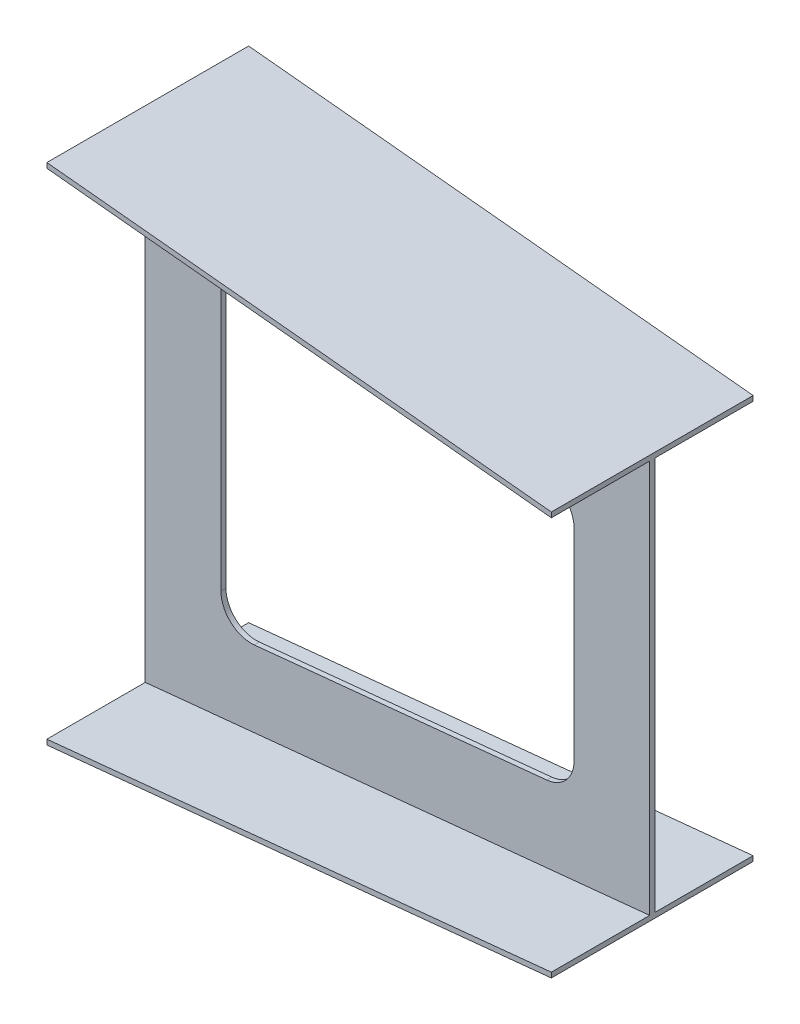
ISO-10303-21;
HEADER;
FILE_DESCRIPTION(('STEP AP214'),'2;1');
FILE_NAME('part.step','',(''),(''),'','','');
FILE_SCHEMA(('AUTOMOTIVE_DESIGN { 1 0 10303 214 1 1 1 1 }'));
ENDSEC;
DATA;
#1=APPLICATION_CONTEXT('core data for automotive mechanical design processes');
#2=APPLICATION_PROTOCOL_DEFINITION('international standard','automotive_design',2000,#1);
#3=PRODUCT_CONTEXT('',#1,'mechanical');
#4=PRODUCT('Part','Part','',(#3));
#5=PRODUCT_RELATED_PRODUCT_CATEGORY('part','',(#4));
#6=PRODUCT_DEFINITION_FORMATION('','',#4);
#7=PRODUCT_DEFINITION_CONTEXT('part definition',#1,'design');
#8=PRODUCT_DEFINITION('design','',#6,#7);
#9=PRODUCT_DEFINITION_SHAPE('','',#8);
#10=(LENGTH_UNIT() NAMED_UNIT(*) SI_UNIT(.MILLI.,.METRE.));
#11=(NAMED_UNIT(*) PLANE_ANGLE_UNIT() SI_UNIT($,.RADIAN.));
#12=(NAMED_UNIT(*) SI_UNIT($,.STERADIAN.) SOLID_ANGLE_UNIT());
#13=UNCERTAINTY_MEASURE_WITH_UNIT(LENGTH_MEASURE(1.E-05),#10,'distance_accuracy_value','');
#14=(GEOMETRIC_REPRESENTATION_CONTEXT(3) GLOBAL_UNCERTAINTY_ASSIGNED_CONTEXT((#13)) GLOBAL_UNIT_ASSIGNED_CONTEXT((#10,
#11,#12)) REPRESENTATION_CONTEXT('',''));
#15=CARTESIAN_POINT('',(0.,0.,0.));
#16=DIRECTION('',(0.,0.,1.));
#17=DIRECTION('',(1.,0.,0.));
#18=AXIS2_PLACEMENT_3D('',#15,#16,#17);
#19=CARTESIAN_POINT('',(1000.,0.,0.));
#20=DIRECTION('',(-1.,0.,0.));
#21=DIRECTION('',(0.,0.,1.));
#22=AXIS2_PLACEMENT_3D('',#19,#20,#21);
#23=PLANE('',#22);
#24=DIRECTION('',(0.,-1.,0.));
#25=VECTOR('',#24,1.);
#26=CARTESIAN_POINT('',(1000.,400.,-195.));
#27=LINE('',#26,#25);
#28=CARTESIAN_POINT('',(1000.,400.,-195.));
#29=VERTEX_POINT('',#28);
#30=CARTESIAN_POINT('',(1000.,390.,-195.));
#31=VERTEX_POINT('',#30);
#32=EDGE_CURVE('E561',#29,#31,#27,.T.);
#33=ORIENTED_EDGE('',*,*,#32,.F.);
#34=DIRECTION('',(0.,0.,-1.));
#35=VECTOR('',#34,1.);
#36=CARTESIAN_POINT('',(1000.,400.,-195.));
#37=LINE('',#36,#35);
#38=CARTESIAN_POINT('',(1000.,400.,205.));
#39=VERTEX_POINT('',#38);
#40=EDGE_CURVE('E12',#39,#29,#37,.T.);
#41=ORIENTED_EDGE('',*,*,#40,.F.);
#42=DIRECTION('',(0.,1.,0.));
#43=VECTOR('',#42,1.);
#44=CARTESIAN_POINT('',(1000.,400.,205.));
#45=LINE('',#44,#43);
#46=CARTESIAN_POINT('',(1000.,390.,205.));
#47=VERTEX_POINT('',#46);
#48=EDGE_CURVE('E71',#47,#39,#45,.T.);
#49=ORIENTED_EDGE('',*,*,#48,.F.);
#50=DIRECTION('',(0.,0.,1.));
#51=VECTOR('',#50,1.);
#52=CARTESIAN_POINT('',(1000.,390.,9.99999999999979));
#53=LINE('',#52,#51);
#54=CARTESIAN_POINT('',(1000.,390.,9.99999999999979));
#55=VERTEX_POINT('',#54);
#56=EDGE_CURVE('E326',#55,#47,#53,.T.);
#57=ORIENTED_EDGE('',*,*,#56,.F.);
#58=DIRECTION('',(0.,1.,0.));
#59=VECTOR('',#58,1.);
#60=CARTESIAN_POINT('',(1000.,390.,9.99999999999979));
#61=LINE('',#60,#59);
#62=CARTESIAN_POINT('',(1000.,-390.,9.99999999999979));
#63=VERTEX_POINT('',#62);
#64=EDGE_CURVE('E766',#63,#55,#61,.T.);
#65=ORIENTED_EDGE('',*,*,#64,.F.);
#66=DIRECTION('',(0.,0.,-1.));
#67=VECTOR('',#66,1.);
#68=CARTESIAN_POINT('',(1000.,-390.,9.99999999999979));
#69=LINE('',#68,#67);
#70=CARTESIAN_POINT('',(1000.,-390.,205.));
#71=VERTEX_POINT('',#70);
#72=EDGE_CURVE('E757',#71,#63,#69,.T.);
#73=ORIENTED_EDGE('',*,*,#72,.F.);
#74=DIRECTION('',(0.,1.,0.));
#75=VECTOR('',#74,1.);
#76=CARTESIAN_POINT('',(1000.,-390.,205.));
#77=LINE('',#76,#75);
#78=CARTESIAN_POINT('',(1000.,-400.,205.));
#79=VERTEX_POINT('',#78);
#80=EDGE_CURVE('E749',#79,#71,#77,.T.);
#81=ORIENTED_EDGE('',*,*,#80,.F.);
#82=DIRECTION('',(0.,0.,1.));
#83=VECTOR('',#82,1.);
#84=CARTESIAN_POINT('',(1000.,-400.,-195.));
#85=LINE('',#84,#83);
#86=CARTESIAN_POINT('',(1000.,-400.,-195.));
#87=VERTEX_POINT('',#86);
#88=EDGE_CURVE('E443',#87,#79,#85,.T.);
#89=ORIENTED_EDGE('',*,*,#88,.F.);
#90=DIRECTION('',(0.,-1.,0.));
#91=VECTOR('',#90,1.);
#92=CARTESIAN_POINT('',(1000.,-390.,-195.));
#93=LINE('',#92,#91);
#94=CARTESIAN_POINT('',(1000.,-390.,-195.));
#95=VERTEX_POINT('',#94);
#96=EDGE_CURVE('E457',#95,#87,#93,.T.);
#97=ORIENTED_EDGE('',*,*,#96,.F.);
#98=DIRECTION('',(0.,0.,-1.));
#99=VECTOR('',#98,1.);
#100=CARTESIAN_POINT('',(1000.,-390.,-195.));
#101=LINE('',#100,#99);
#102=CARTESIAN_POINT('',(1000.,-390.,0.));
#103=VERTEX_POINT('',#102);
#104=EDGE_CURVE('E727',#103,#95,#101,.T.);
#105=ORIENTED_EDGE('',*,*,#104,.F.);
#106=DIRECTION('',(0.,-1.,0.));
#107=VECTOR('',#106,1.);
#108=CARTESIAN_POINT('',(1000.,390.,0.));
#109=LINE('',#108,#107);
#110=CARTESIAN_POINT('',(1000.,390.,0.));
#111=VERTEX_POINT('',#110);
#112=EDGE_CURVE('E703',#111,#103,#109,.T.);
#113=ORIENTED_EDGE('',*,*,#112,.F.);
#114=DIRECTION('',(0.,0.,1.));
#115=VECTOR('',#114,1.);
#116=CARTESIAN_POINT('',(1000.,390.,-195.));
#117=LINE('',#116,#115);
#118=EDGE_CURVE('E547',#31,#111,#117,.T.);
#119=ORIENTED_EDGE('',*,*,#118,.F.);
#120=EDGE_LOOP('',(#33,#41,#49,#57,#65,#73,#81,#89,#97,#105,#113,#119));
#121=FACE_BOUND('',#120,.T.);
#122=ADVANCED_FACE('F61',(#121),#23,.F.);
#123=CARTESIAN_POINT('',(0.,0.,0.));
#124=DIRECTION('',(1.,0.,0.));
#125=DIRECTION('',(0.,0.,-1.));
#126=AXIS2_PLACEMENT_3D('',#123,#124,#125);
#127=PLANE('',#126);
#128=DIRECTION('',(0.,-1.,0.));
#129=VECTOR('',#128,1.);
#130=CARTESIAN_POINT('',(0.,500.,205.));
#131=LINE('',#130,#129);
#132=CARTESIAN_POINT('',(0.,500.,205.));
#133=VERTEX_POINT('',#132);
#134=CARTESIAN_POINT('',(0.,490.,205.));
#135=VERTEX_POINT('',#134);
#136=EDGE_CURVE('E258',#133,#135,#131,.T.);
#137=ORIENTED_EDGE('',*,*,#136,.F.);
#138=DIRECTION('',(0.,0.,1.));
#139=VECTOR('',#138,1.);
#140=CARTESIAN_POINT('',(0.,500.,205.));
#141=LINE('',#140,#139);
#142=CARTESIAN_POINT('',(0.,500.,-195.));
#143=VERTEX_POINT('',#142);
#144=EDGE_CURVE('E275',#143,#133,#141,.T.);
#145=ORIENTED_EDGE('',*,*,#144,.F.);
#146=DIRECTION('',(0.,1.,0.));
#147=VECTOR('',#146,1.);
#148=CARTESIAN_POINT('',(0.,500.,-195.));
#149=LINE('',#148,#147);
#150=CARTESIAN_POINT('',(0.,490.,-195.));
#151=VERTEX_POINT('',#150);
#152=EDGE_CURVE('E576',#151,#143,#149,.T.);
#153=ORIENTED_EDGE('',*,*,#152,.F.);
#154=DIRECTION('',(0.,0.,-1.));
#155=VECTOR('',#154,1.);
#156=CARTESIAN_POINT('',(0.,490.,0.));
#157=LINE('',#156,#155);
#158=CARTESIAN_POINT('',(0.,490.,0.));
#159=VERTEX_POINT('',#158);
#160=EDGE_CURVE('E682',#159,#151,#157,.T.);
#161=ORIENTED_EDGE('',*,*,#160,.F.);
#162=DIRECTION('',(0.,1.,0.));
#163=VECTOR('',#162,1.);
#164=CARTESIAN_POINT('',(0.,490.,0.));
#165=LINE('',#164,#163);
#166=CARTESIAN_POINT('',(0.,-490.,-1.11022302462516E-13));
#167=VERTEX_POINT('',#166);
#168=EDGE_CURVE('E516',#167,#159,#165,.T.);
#169=ORIENTED_EDGE('',*,*,#168,.F.);
#170=DIRECTION('',(0.,0.,1.));
#171=VECTOR('',#170,1.);
#172=CARTESIAN_POINT('',(0.,-490.,-1.11022302462516E-13));
#173=LINE('',#172,#171);
#174=CARTESIAN_POINT('',(0.,-490.,-195.));
#175=VERTEX_POINT('',#174);
#176=EDGE_CURVE('E499',#175,#167,#173,.T.);
#177=ORIENTED_EDGE('',*,*,#176,.F.);
#178=DIRECTION('',(0.,1.,0.));
#179=VECTOR('',#178,1.);
#180=CARTESIAN_POINT('',(0.,-490.,-195.));
#181=LINE('',#180,#179);
#182=CARTESIAN_POINT('',(0.,-500.,-195.));
#183=VERTEX_POINT('',#182);
#184=EDGE_CURVE('E675',#183,#175,#181,.T.);
#185=ORIENTED_EDGE('',*,*,#184,.F.);
#186=DIRECTION('',(0.,0.,-1.));
#187=VECTOR('',#186,1.);
#188=CARTESIAN_POINT('',(0.,-500.,205.));
#189=LINE('',#188,#187);
#190=CARTESIAN_POINT('',(0.,-500.,205.));
#191=VERTEX_POINT('',#190);
#192=EDGE_CURVE('E671',#191,#183,#189,.T.);
#193=ORIENTED_EDGE('',*,*,#192,.F.);
#194=DIRECTION('',(0.,-1.,0.));
#195=VECTOR('',#194,1.);
#196=CARTESIAN_POINT('',(0.,-490.,205.));
#197=LINE('',#196,#195);
#198=CARTESIAN_POINT('',(0.,-490.,205.));
#199=VERTEX_POINT('',#198);
#200=EDGE_CURVE('E408',#199,#191,#197,.T.);
#201=ORIENTED_EDGE('',*,*,#200,.F.);
#202=DIRECTION('',(0.,0.,1.));
#203=VECTOR('',#202,1.);
#204=CARTESIAN_POINT('',(0.,-490.,205.));
#205=LINE('',#204,#203);
#206=CARTESIAN_POINT('',(0.,-490.,9.99999999999988));
#207=VERTEX_POINT('',#206);
#208=EDGE_CURVE('E390',#207,#199,#205,.T.);
#209=ORIENTED_EDGE('',*,*,#208,.F.);
#210=DIRECTION('',(0.,-1.,0.));
#211=VECTOR('',#210,1.);
#212=CARTESIAN_POINT('',(0.,490.,10.));
#213=LINE('',#212,#211);
#214=CARTESIAN_POINT('',(0.,490.,10.));
#215=VERTEX_POINT('',#214);
#216=EDGE_CURVE('E373',#215,#207,#213,.T.);
#217=ORIENTED_EDGE('',*,*,#216,.F.);
#218=DIRECTION('',(0.,0.,-1.));
#219=VECTOR('',#218,1.);
#220=CARTESIAN_POINT('',(0.,490.,205.));
#221=LINE('',#220,#219);
#222=EDGE_CURVE('E659',#135,#215,#221,.T.);
#223=ORIENTED_EDGE('',*,*,#222,.F.);
#224=EDGE_LOOP('',(#137,#145,#153,#161,#169,#177,#185,#193,#201,#209,#217,#223));
#225=FACE_BOUND('',#224,.T.);
#226=ADVANCED_FACE('F588',(#225),#127,.F.);
#227=CARTESIAN_POINT('',(0.,0.,9.99999999999988));
#228=DIRECTION('',(0.,0.,1.));
#229=DIRECTION('',(1.,0.,0.));
#230=AXIS2_PLACEMENT_3D('',#227,#228,#229);
#231=PLANE('',#230);
#232=CARTESIAN_POINT('',(210.,-257.952611956461,9.99999999999988));
#233=DIRECTION('',(0.,0.,1.));
#234=DIRECTION('',(1.,0.,0.));
#235=AXIS2_PLACEMENT_3D('',#232,#233,#234);
#236=CIRCLE('',#235,60.);
#237=CARTESIAN_POINT('',(150.,-257.952611956461,9.99999999999988));
#238=VERTEX_POINT('',#237);
#239=CARTESIAN_POINT('',(215.97022314126,-317.654843369061,9.99999999999986));
#240=VERTEX_POINT('',#239);
#241=EDGE_CURVE('E79',#238,#240,#236,.T.);
#242=ORIENTED_EDGE('',*,*,#241,.F.);
#243=DIRECTION('',(0.,-1.,0.));
#244=VECTOR('',#243,1.);
#245=CARTESIAN_POINT('',(150.,257.952611956461,9.99999999999988));
#246=LINE('',#245,#244);
#247=CARTESIAN_POINT('',(150.,257.952611956461,9.99999999999988));
#248=VERTEX_POINT('',#247);
#249=EDGE_CURVE('E220',#248,#238,#246,.T.);
#250=ORIENTED_EDGE('',*,*,#249,.F.);
#251=CARTESIAN_POINT('',(210.,257.952611956461,9.99999999999988));
#252=DIRECTION('',(0.,0.,1.));
#253=DIRECTION('',(-1.,0.,0.));
#254=AXIS2_PLACEMENT_3D('',#251,#252,#253);
#255=CIRCLE('',#254,60.);
#256=CARTESIAN_POINT('',(215.97022314126,317.654843369061,9.99999999999988));
#257=VERTEX_POINT('',#256);
#258=EDGE_CURVE('E223',#257,#248,#255,.T.);
#259=ORIENTED_EDGE('',*,*,#258,.F.);
#260=DIRECTION('',(-0.995037190209989,0.0995037190209989,0.));
#261=VECTOR('',#260,1.);
#262=CARTESIAN_POINT('',(795.97022314126,259.654843369061,9.99999999999988));
#263=LINE('',#262,#261);
#264=CARTESIAN_POINT('',(795.97022314126,259.654843369061,9.99999999999988));
#265=VERTEX_POINT('',#264);
#266=EDGE_CURVE('E251',#265,#257,#263,.T.);
#267=ORIENTED_EDGE('',*,*,#266,.F.);
#268=CARTESIAN_POINT('',(790.,199.952611956461,9.99999999999988));
#269=DIRECTION('',(0.,0.,1.));
#270=DIRECTION('',(1.,0.,0.));
#271=AXIS2_PLACEMENT_3D('',#268,#269,#270);
#272=CIRCLE('',#271,60.);
#273=CARTESIAN_POINT('',(850.,199.952611956461,9.99999999999988));
#274=VERTEX_POINT('',#273);
#275=EDGE_CURVE('E248',#274,#265,#272,.T.);
#276=ORIENTED_EDGE('',*,*,#275,.F.);
#277=DIRECTION('',(0.,1.,0.));
#278=VECTOR('',#277,1.);
#279=CARTESIAN_POINT('',(850.,-199.952611956461,9.99999999999988));
#280=LINE('',#279,#278);
#281=CARTESIAN_POINT('',(850.,-199.952611956461,9.99999999999988));
#282=VERTEX_POINT('',#281);
#283=EDGE_CURVE('E245',#282,#274,#280,.T.);
#284=ORIENTED_EDGE('',*,*,#283,.F.);
#285=CARTESIAN_POINT('',(790.,-199.952611956461,9.99999999999988));
#286=DIRECTION('',(0.,0.,1.));
#287=DIRECTION('',(-1.,0.,0.));
#288=AXIS2_PLACEMENT_3D('',#285,#286,#287);
#289=CIRCLE('',#288,60.);
#290=CARTESIAN_POINT('',(795.97022314126,-259.654843369061,9.99999999999988));
#291=VERTEX_POINT('',#290);
#292=EDGE_CURVE('E242',#291,#282,#289,.T.);
#293=ORIENTED_EDGE('',*,*,#292,.F.);
#294=DIRECTION('',(0.995037190209989,0.0995037190209989,0.));
#295=VECTOR('',#294,1.);
#296=CARTESIAN_POINT('',(215.97022314126,-317.654843369061,9.99999999999988));
#297=LINE('',#296,#295);
#298=EDGE_CURVE('E240',#240,#291,#297,.T.);
#299=ORIENTED_EDGE('',*,*,#298,.F.);
#300=EDGE_LOOP('',(#242,#250,#259,#267,#276,#284,#293,#299));
#301=FACE_BOUND('',#300,.T.);
#302=DIRECTION('',(0.995037190209989,0.099503719020999,0.));
#303=VECTOR('',#302,1.);
#304=CARTESIAN_POINT('',(0.,-490.,9.99999999999988));
#305=LINE('',#304,#303);
#306=EDGE_CURVE('E365',#207,#63,#305,.T.);
#307=ORIENTED_EDGE('',*,*,#306,.T.);
#308=ORIENTED_EDGE('',*,*,#64,.T.);
#309=DIRECTION('',(0.995037190209989,-0.0995037190209989,0.));
#310=VECTOR('',#309,1.);
#311=CARTESIAN_POINT('',(0.,490.,10.));
#312=LINE('',#311,#310);
#313=EDGE_CURVE('E357',#215,#55,#312,.T.);
#314=ORIENTED_EDGE('',*,*,#313,.F.);
#315=ORIENTED_EDGE('',*,*,#216,.T.);
#316=EDGE_LOOP('',(#307,#308,#314,#315));
#317=FACE_BOUND('',#316,.T.);
#318=ADVANCED_FACE('F344',(#301,#317),#231,.T.);
#319=CARTESIAN_POINT('',(48.5148514851485,485.148514851485,0.));
#320=DIRECTION('',(-0.0995037190209989,-0.995037190209989,0.));
#321=DIRECTION('',(0.995037190209989,-0.0995037190209989,0.));
#322=AXIS2_PLACEMENT_3D('',#319,#320,#321);
#323=PLANE('',#322);
#324=ORIENTED_EDGE('',*,*,#313,.T.);
#325=ORIENTED_EDGE('',*,*,#56,.T.);
#326=DIRECTION('',(0.995037190209989,-0.0995037190209989,0.));
#327=VECTOR('',#326,1.);
#328=CARTESIAN_POINT('',(0.,490.,205.));
#329=LINE('',#328,#327);
#330=EDGE_CURVE('E690',#135,#47,#329,.T.);
#331=ORIENTED_EDGE('',*,*,#330,.F.);
#332=ORIENTED_EDGE('',*,*,#222,.T.);
#333=EDGE_LOOP('',(#324,#325,#331,#332));
#334=FACE_BOUND('',#333,.T.);
#335=ADVANCED_FACE('F333',(#334),#323,.T.);
#336=CARTESIAN_POINT('',(48.5148514851485,-485.148514851485,-1.3810847475662E-13));
#337=DIRECTION('',(-0.0995037190209989,0.995037190209989,0.));
#338=DIRECTION('',(-0.995037190209989,-0.0995037190209989,0.));
#339=AXIS2_PLACEMENT_3D('',#336,#337,#338);
#340=PLANE('',#339);
#341=DIRECTION('',(0.995037190209989,0.0995037190209989,0.));
#342=VECTOR('',#341,1.);
#343=CARTESIAN_POINT('',(0.,-490.,205.));
#344=LINE('',#343,#342);
#345=EDGE_CURVE('E364',#199,#71,#344,.T.);
#346=ORIENTED_EDGE('',*,*,#345,.T.);
#347=ORIENTED_EDGE('',*,*,#72,.T.);
#348=ORIENTED_EDGE('',*,*,#306,.F.);
#349=ORIENTED_EDGE('',*,*,#208,.T.);
#350=EDGE_LOOP('',(#346,#347,#348,#349));
#351=FACE_BOUND('',#350,.T.);
#352=ADVANCED_FACE('F343',(#351),#340,.T.);
#353=CARTESIAN_POINT('',(0.,0.,205.));
#354=DIRECTION('',(0.,0.,1.));
#355=DIRECTION('',(1.,0.,0.));
#356=AXIS2_PLACEMENT_3D('',#353,#354,#355);
#357=PLANE('',#356);
#358=DIRECTION('',(0.995037190209989,0.0995037190209989,0.));
#359=VECTOR('',#358,1.);
#360=CARTESIAN_POINT('',(0.,-500.,205.));
#361=LINE('',#360,#359);
#362=EDGE_CURVE('E401',#191,#79,#361,.T.);
#363=ORIENTED_EDGE('',*,*,#362,.T.);
#364=ORIENTED_EDGE('',*,*,#80,.T.);
#365=ORIENTED_EDGE('',*,*,#345,.F.);
#366=ORIENTED_EDGE('',*,*,#200,.T.);
#367=EDGE_LOOP('',(#363,#364,#365,#366));
#368=FACE_BOUND('',#367,.T.);
#369=ADVANCED_FACE('F414',(#368),#357,.T.);
#370=CARTESIAN_POINT('',(49.5049504950494,-495.049504950495,0.));
#371=DIRECTION('',(0.0995037190209988,-0.995037190209989,0.));
#372=DIRECTION('',(0.995037190209989,0.0995037190209988,0.));
#373=AXIS2_PLACEMENT_3D('',#370,#371,#372);
#374=PLANE('',#373);
#375=DIRECTION('',(0.995037190209989,0.0995037190209988,0.));
#376=VECTOR('',#375,1.);
#377=CARTESIAN_POINT('',(0.,-500.,-195.));
#378=LINE('',#377,#376);
#379=EDGE_CURVE('E491',#183,#87,#378,.T.);
#380=ORIENTED_EDGE('',*,*,#379,.T.);
#381=ORIENTED_EDGE('',*,*,#88,.T.);
#382=ORIENTED_EDGE('',*,*,#362,.F.);
#383=ORIENTED_EDGE('',*,*,#192,.T.);
#384=EDGE_LOOP('',(#380,#381,#382,#383));
#385=FACE_BOUND('',#384,.T.);
#386=ADVANCED_FACE('F423',(#385),#374,.T.);
#387=CARTESIAN_POINT('',(0.,0.,-195.));
#388=DIRECTION('',(0.,0.,-1.));
#389=DIRECTION('',(-1.,0.,0.));
#390=AXIS2_PLACEMENT_3D('',#387,#388,#389);
#391=PLANE('',#390);
#392=DIRECTION('',(0.995037190209989,0.0995037190209988,0.));
#393=VECTOR('',#392,1.);
#394=CARTESIAN_POINT('',(0.,-490.,-195.));
#395=LINE('',#394,#393);
#396=EDGE_CURVE('E483',#175,#95,#395,.T.);
#397=ORIENTED_EDGE('',*,*,#396,.T.);
#398=ORIENTED_EDGE('',*,*,#96,.T.);
#399=ORIENTED_EDGE('',*,*,#379,.F.);
#400=ORIENTED_EDGE('',*,*,#184,.T.);
#401=EDGE_LOOP('',(#397,#398,#399,#400));
#402=FACE_BOUND('',#401,.T.);
#403=ADVANCED_FACE('F463',(#402),#391,.T.);
#404=CARTESIAN_POINT('',(48.5148514851485,-485.148514851485,1.3810847475662E-13));
#405=DIRECTION('',(-0.099503719020999,0.995037190209989,0.));
#406=DIRECTION('',(-0.995037190209989,-0.099503719020999,0.));
#407=AXIS2_PLACEMENT_3D('',#404,#405,#406);
#408=PLANE('',#407);
#409=DIRECTION('',(0.995037190209989,0.099503719020999,0.));
#410=VECTOR('',#409,1.);
#411=CARTESIAN_POINT('',(0.,-490.,-1.11022302462516E-13));
#412=LINE('',#411,#410);
#413=EDGE_CURVE('E490',#167,#103,#412,.T.);
#414=ORIENTED_EDGE('',*,*,#413,.T.);
#415=ORIENTED_EDGE('',*,*,#104,.T.);
#416=ORIENTED_EDGE('',*,*,#396,.F.);
#417=ORIENTED_EDGE('',*,*,#176,.T.);
#418=EDGE_LOOP('',(#414,#415,#416,#417));
#419=FACE_BOUND('',#418,.T.);
#420=ADVANCED_FACE('F472',(#419),#408,.T.);
#421=CARTESIAN_POINT('',(0.,0.,0.));
#422=DIRECTION('',(0.,0.,-1.));
#423=DIRECTION('',(-1.,0.,0.));
#424=AXIS2_PLACEMENT_3D('',#421,#422,#423);
#425=PLANE('',#424);
#426=CARTESIAN_POINT('',(210.,-257.952611956461,-1.16226472890446E-13));
#427=DIRECTION('',(0.,0.,1.));
#428=DIRECTION('',(1.,0.,0.));
#429=AXIS2_PLACEMENT_3D('',#426,#427,#428);
#430=CIRCLE('',#429,60.);
#431=CARTESIAN_POINT('',(150.,-257.952611956461,-1.16226472890446E-13));
#432=VERTEX_POINT('',#431);
#433=CARTESIAN_POINT('',(215.97022314126,-317.654843369061,-1.16226472890446E-13));
#434=VERTEX_POINT('',#433);
#435=EDGE_CURVE('E203',#432,#434,#430,.T.);
#436=ORIENTED_EDGE('',*,*,#435,.T.);
#437=DIRECTION('',(0.995037190209989,0.0995037190209989,0.));
#438=VECTOR('',#437,1.);
#439=CARTESIAN_POINT('',(215.97022314126,-317.654843369061,-1.16226472890446E-13));
#440=LINE('',#439,#438);
#441=CARTESIAN_POINT('',(795.97022314126,-259.654843369061,0.));
#442=VERTEX_POINT('',#441);
#443=EDGE_CURVE('E212',#434,#442,#440,.T.);
#444=ORIENTED_EDGE('',*,*,#443,.T.);
#445=CARTESIAN_POINT('',(790.,-199.952611956461,-1.16226472890446E-13));
#446=DIRECTION('',(0.,0.,1.));
#447=DIRECTION('',(-1.,0.,0.));
#448=AXIS2_PLACEMENT_3D('',#445,#446,#447);
#449=CIRCLE('',#448,60.);
#450=CARTESIAN_POINT('',(850.,-199.952611956461,-1.16226472890446E-13));
#451=VERTEX_POINT('',#450);
#452=EDGE_CURVE('E87',#442,#451,#449,.T.);
#453=ORIENTED_EDGE('',*,*,#452,.T.);
#454=DIRECTION('',(0.,1.,0.));
#455=VECTOR('',#454,1.);
#456=CARTESIAN_POINT('',(850.,-199.952611956461,-1.16226472890446E-13));
#457=LINE('',#456,#455);
#458=CARTESIAN_POINT('',(850.,199.952611956461,-1.16226472890446E-13));
#459=VERTEX_POINT('',#458);
#460=EDGE_CURVE('E227',#451,#459,#457,.T.);
#461=ORIENTED_EDGE('',*,*,#460,.T.);
#462=CARTESIAN_POINT('',(790.,199.952611956461,-1.16226472890446E-13));
#463=DIRECTION('',(0.,0.,1.));
#464=DIRECTION('',(1.,0.,0.));
#465=AXIS2_PLACEMENT_3D('',#462,#463,#464);
#466=CIRCLE('',#465,60.);
#467=CARTESIAN_POINT('',(795.97022314126,259.654843369061,-1.16226472890446E-13));
#468=VERTEX_POINT('',#467);
#469=EDGE_CURVE('E230',#459,#468,#466,.T.);
#470=ORIENTED_EDGE('',*,*,#469,.T.);
#471=DIRECTION('',(-0.995037190209989,0.0995037190209989,0.));
#472=VECTOR('',#471,1.);
#473=CARTESIAN_POINT('',(795.97022314126,259.654843369061,-1.16226472890446E-13));
#474=LINE('',#473,#472);
#475=CARTESIAN_POINT('',(215.97022314126,317.654843369061,-1.16226472890446E-13));
#476=VERTEX_POINT('',#475);
#477=EDGE_CURVE('E233',#468,#476,#474,.T.);
#478=ORIENTED_EDGE('',*,*,#477,.T.);
#479=CARTESIAN_POINT('',(210.,257.952611956461,-1.16226472890446E-13));
#480=DIRECTION('',(0.,0.,1.));
#481=DIRECTION('',(-1.,0.,0.));
#482=AXIS2_PLACEMENT_3D('',#479,#480,#481);
#483=CIRCLE('',#482,60.);
#484=CARTESIAN_POINT('',(150.,257.952611956461,-1.16226472890446E-13));
#485=VERTEX_POINT('',#484);
#486=EDGE_CURVE('E236',#476,#485,#483,.T.);
#487=ORIENTED_EDGE('',*,*,#486,.T.);
#488=DIRECTION('',(0.,-1.,0.));
#489=VECTOR('',#488,1.);
#490=CARTESIAN_POINT('',(150.,257.952611956461,-1.16226472890446E-13));
#491=LINE('',#490,#489);
#492=EDGE_CURVE('E209',#485,#432,#491,.T.);
#493=ORIENTED_EDGE('',*,*,#492,.T.);
#494=EDGE_LOOP('',(#436,#444,#453,#461,#470,#478,#487,#493));
#495=FACE_BOUND('',#494,.T.);
#496=DIRECTION('',(0.995037190209989,-0.0995037190209989,0.));
#497=VECTOR('',#496,1.);
#498=CARTESIAN_POINT('',(0.,490.,0.));
#499=LINE('',#498,#497);
#500=EDGE_CURVE('E510',#159,#111,#499,.T.);
#501=ORIENTED_EDGE('',*,*,#500,.T.);
#502=ORIENTED_EDGE('',*,*,#112,.T.);
#503=ORIENTED_EDGE('',*,*,#413,.F.);
#504=ORIENTED_EDGE('',*,*,#168,.T.);
#505=EDGE_LOOP('',(#501,#502,#503,#504));
#506=FACE_BOUND('',#505,.T.);
#507=ADVANCED_FACE('F216',(#495,#506),#425,.T.);
#508=CARTESIAN_POINT('',(48.5148514851486,485.148514851485,0.));
#509=DIRECTION('',(-0.099503719020999,-0.995037190209989,0.));
#510=DIRECTION('',(0.995037190209989,-0.099503719020999,0.));
#511=AXIS2_PLACEMENT_3D('',#508,#509,#510);
#512=PLANE('',#511);
#513=DIRECTION('',(0.995037190209989,-0.099503719020999,0.));
#514=VECTOR('',#513,1.);
#515=CARTESIAN_POINT('',(0.,490.,-195.));
#516=LINE('',#515,#514);
#517=EDGE_CURVE('E687',#151,#31,#516,.T.);
#518=ORIENTED_EDGE('',*,*,#517,.T.);
#519=ORIENTED_EDGE('',*,*,#118,.T.);
#520=ORIENTED_EDGE('',*,*,#500,.F.);
#521=ORIENTED_EDGE('',*,*,#160,.T.);
#522=EDGE_LOOP('',(#518,#519,#520,#521));
#523=FACE_BOUND('',#522,.T.);
#524=ADVANCED_FACE('F529',(#523),#512,.T.);
#525=CARTESIAN_POINT('',(0.,0.,-195.));
#526=DIRECTION('',(0.,0.,-1.));
#527=DIRECTION('',(-1.,0.,0.));
#528=AXIS2_PLACEMENT_3D('',#525,#526,#527);
#529=PLANE('',#528);
#530=DIRECTION('',(0.995037190209989,-0.099503719020999,0.));
#531=VECTOR('',#530,1.);
#532=CARTESIAN_POINT('',(0.,500.,-195.));
#533=LINE('',#532,#531);
#534=EDGE_CURVE('E281',#143,#29,#533,.T.);
#535=ORIENTED_EDGE('',*,*,#534,.T.);
#536=ORIENTED_EDGE('',*,*,#32,.T.);
#537=ORIENTED_EDGE('',*,*,#517,.F.);
#538=ORIENTED_EDGE('',*,*,#152,.T.);
#539=EDGE_LOOP('',(#535,#536,#537,#538));
#540=FACE_BOUND('',#539,.T.);
#541=ADVANCED_FACE('F293',(#540),#529,.T.);
#542=CARTESIAN_POINT('',(49.5049504950495,495.049504950495,0.));
#543=DIRECTION('',(0.0995037190209989,0.995037190209989,0.));
#544=DIRECTION('',(-0.995037190209989,0.0995037190209989,0.));
#545=AXIS2_PLACEMENT_3D('',#542,#543,#544);
#546=PLANE('',#545);
#547=DIRECTION('',(0.995037190209989,-0.0995037190209989,0.));
#548=VECTOR('',#547,1.);
#549=CARTESIAN_POINT('',(0.,500.,205.));
#550=LINE('',#549,#548);
#551=EDGE_CURVE('E689',#133,#39,#550,.T.);
#552=ORIENTED_EDGE('',*,*,#551,.T.);
#553=ORIENTED_EDGE('',*,*,#40,.T.);
#554=ORIENTED_EDGE('',*,*,#534,.F.);
#555=ORIENTED_EDGE('',*,*,#144,.T.);
#556=EDGE_LOOP('',(#552,#553,#554,#555));
#557=FACE_BOUND('',#556,.T.);
#558=ADVANCED_FACE('F283',(#557),#546,.T.);
#559=CARTESIAN_POINT('',(0.,0.,205.));
#560=DIRECTION('',(0.,0.,1.));
#561=DIRECTION('',(1.,0.,0.));
#562=AXIS2_PLACEMENT_3D('',#559,#560,#561);
#563=PLANE('',#562);
#564=ORIENTED_EDGE('',*,*,#330,.T.);
#565=ORIENTED_EDGE('',*,*,#48,.T.);
#566=ORIENTED_EDGE('',*,*,#551,.F.);
#567=ORIENTED_EDGE('',*,*,#136,.T.);
#568=EDGE_LOOP('',(#564,#565,#566,#567));
#569=FACE_BOUND('',#568,.T.);
#570=ADVANCED_FACE('F292',(#569),#563,.T.);
#571=CARTESIAN_POINT('',(210.,-257.952611956461,-1.16226472890446E-13));
#572=DIRECTION('',(0.,0.,1.));
#573=DIRECTION('',(1.,0.,0.));
#574=AXIS2_PLACEMENT_3D('',#571,#572,#573);
#575=CYLINDRICAL_SURFACE('',#574,60.);
#576=ORIENTED_EDGE('',*,*,#241,.T.);
#577=DIRECTION('',(0.,0.,1.));
#578=VECTOR('',#577,1.);
#579=CARTESIAN_POINT('',(215.97022314126,-317.654843369061,-1.16226472890446E-13));
#580=LINE('',#579,#578);
#581=EDGE_CURVE('E199',#434,#240,#580,.T.);
#582=ORIENTED_EDGE('',*,*,#581,.F.);
#583=ORIENTED_EDGE('',*,*,#435,.F.);
#584=DIRECTION('',(0.,0.,1.));
#585=VECTOR('',#584,1.);
#586=CARTESIAN_POINT('',(150.,-257.952611956461,-1.16226472890446E-13));
#587=LINE('',#586,#585);
#588=EDGE_CURVE('E256',#432,#238,#587,.T.);
#589=ORIENTED_EDGE('',*,*,#588,.T.);
#590=EDGE_LOOP('',(#576,#582,#583,#589));
#591=FACE_BOUND('',#590,.T.);
#592=ADVANCED_FACE('F201',(#591),#575,.F.);
#593=CARTESIAN_POINT('',(150.,257.952611956461,-1.16226472890446E-13));
#594=DIRECTION('',(-1.,0.,0.));
#595=DIRECTION('',(0.,0.,1.));
#596=AXIS2_PLACEMENT_3D('',#593,#594,#595);
#597=PLANE('',#596);
#598=ORIENTED_EDGE('',*,*,#249,.T.);
#599=ORIENTED_EDGE('',*,*,#588,.F.);
#600=ORIENTED_EDGE('',*,*,#492,.F.);
#601=DIRECTION('',(0.,0.,1.));
#602=VECTOR('',#601,1.);
#603=CARTESIAN_POINT('',(150.,257.952611956461,-1.16226472890446E-13));
#604=LINE('',#603,#602);
#605=EDGE_CURVE('E259',#485,#248,#604,.T.);
#606=ORIENTED_EDGE('',*,*,#605,.T.);
#607=EDGE_LOOP('',(#598,#599,#600,#606));
#608=FACE_BOUND('',#607,.T.);
#609=ADVANCED_FACE('F822',(#608),#597,.F.);
#610=CARTESIAN_POINT('',(210.,257.952611956461,-1.16226472890446E-13));
#611=DIRECTION('',(0.,0.,1.));
#612=DIRECTION('',(1.,0.,0.));
#613=AXIS2_PLACEMENT_3D('',#610,#611,#612);
#614=CYLINDRICAL_SURFACE('',#613,60.);
#615=ORIENTED_EDGE('',*,*,#258,.T.);
#616=ORIENTED_EDGE('',*,*,#605,.F.);
#617=ORIENTED_EDGE('',*,*,#486,.F.);
#618=DIRECTION('',(0.,0.,1.));
#619=VECTOR('',#618,1.);
#620=CARTESIAN_POINT('',(215.97022314126,317.654843369061,-1.16226472890446E-13));
#621=LINE('',#620,#619);
#622=EDGE_CURVE('E261',#476,#257,#621,.T.);
#623=ORIENTED_EDGE('',*,*,#622,.T.);
#624=EDGE_LOOP('',(#615,#616,#617,#623));
#625=FACE_BOUND('',#624,.T.);
#626=ADVANCED_FACE('F826',(#625),#614,.F.);
#627=CARTESIAN_POINT('',(795.97022314126,259.654843369061,-1.16226472890446E-13));
#628=DIRECTION('',(0.0995037190209989,0.995037190209989,0.));
#629=DIRECTION('',(-0.995037190209989,0.0995037190209989,0.));
#630=AXIS2_PLACEMENT_3D('',#627,#628,#629);
#631=PLANE('',#630);
#632=ORIENTED_EDGE('',*,*,#266,.T.);
#633=ORIENTED_EDGE('',*,*,#622,.F.);
#634=ORIENTED_EDGE('',*,*,#477,.F.);
#635=DIRECTION('',(0.,0.,1.));
#636=VECTOR('',#635,1.);
#637=CARTESIAN_POINT('',(795.97022314126,259.654843369061,-1.16226472890446E-13));
#638=LINE('',#637,#636);
#639=EDGE_CURVE('E263',#468,#265,#638,.T.);
#640=ORIENTED_EDGE('',*,*,#639,.T.);
#641=EDGE_LOOP('',(#632,#633,#634,#640));
#642=FACE_BOUND('',#641,.T.);
#643=ADVANCED_FACE('F832',(#642),#631,.F.);
#644=CARTESIAN_POINT('',(790.,199.952611956461,-1.16226472890446E-13));
#645=DIRECTION('',(0.,0.,1.));
#646=DIRECTION('',(1.,0.,0.));
#647=AXIS2_PLACEMENT_3D('',#644,#645,#646);
#648=CYLINDRICAL_SURFACE('',#647,60.);
#649=ORIENTED_EDGE('',*,*,#275,.T.);
#650=ORIENTED_EDGE('',*,*,#639,.F.);
#651=ORIENTED_EDGE('',*,*,#469,.F.);
#652=DIRECTION('',(0.,0.,1.));
#653=VECTOR('',#652,1.);
#654=CARTESIAN_POINT('',(850.,199.952611956461,-1.16226472890446E-13));
#655=LINE('',#654,#653);
#656=EDGE_CURVE('E265',#459,#274,#655,.T.);
#657=ORIENTED_EDGE('',*,*,#656,.T.);
#658=EDGE_LOOP('',(#649,#650,#651,#657));
#659=FACE_BOUND('',#658,.T.);
#660=ADVANCED_FACE('F838',(#659),#648,.F.);
#661=CARTESIAN_POINT('',(850.,-199.952611956461,-1.16226472890446E-13));
#662=DIRECTION('',(1.,0.,0.));
#663=DIRECTION('',(0.,0.,-1.));
#664=AXIS2_PLACEMENT_3D('',#661,#662,#663);
#665=PLANE('',#664);
#666=ORIENTED_EDGE('',*,*,#283,.T.);
#667=ORIENTED_EDGE('',*,*,#656,.F.);
#668=ORIENTED_EDGE('',*,*,#460,.F.);
#669=DIRECTION('',(0.,0.,1.));
#670=VECTOR('',#669,1.);
#671=CARTESIAN_POINT('',(850.,-199.952611956461,-1.16226472890446E-13));
#672=LINE('',#671,#670);
#673=EDGE_CURVE('E267',#451,#282,#672,.T.);
#674=ORIENTED_EDGE('',*,*,#673,.T.);
#675=EDGE_LOOP('',(#666,#667,#668,#674));
#676=FACE_BOUND('',#675,.T.);
#677=ADVANCED_FACE('F842',(#676),#665,.F.);
#678=CARTESIAN_POINT('',(790.,-199.952611956461,-1.16226472890446E-13));
#679=DIRECTION('',(0.,0.,1.));
#680=DIRECTION('',(1.,0.,0.));
#681=AXIS2_PLACEMENT_3D('',#678,#679,#680);
#682=CYLINDRICAL_SURFACE('',#681,60.);
#683=ORIENTED_EDGE('',*,*,#292,.T.);
#684=ORIENTED_EDGE('',*,*,#673,.F.);
#685=ORIENTED_EDGE('',*,*,#452,.F.);
#686=DIRECTION('',(0.,0.,1.));
#687=VECTOR('',#686,1.);
#688=CARTESIAN_POINT('',(795.97022314126,-259.654843369061,-1.16226472890446E-13));
#689=LINE('',#688,#687);
#690=EDGE_CURVE('E208',#442,#291,#689,.T.);
#691=ORIENTED_EDGE('',*,*,#690,.T.);
#692=EDGE_LOOP('',(#683,#684,#685,#691));
#693=FACE_BOUND('',#692,.T.);
#694=ADVANCED_FACE('F846',(#693),#682,.F.);
#695=CARTESIAN_POINT('',(215.97022314126,-317.654843369061,-1.16226472890446E-13));
#696=DIRECTION('',(0.0995037190209989,-0.995037190209989,0.));
#697=DIRECTION('',(0.995037190209989,0.0995037190209989,0.));
#698=AXIS2_PLACEMENT_3D('',#695,#696,#697);
#699=PLANE('',#698);
#700=ORIENTED_EDGE('',*,*,#298,.T.);
#701=ORIENTED_EDGE('',*,*,#690,.F.);
#702=ORIENTED_EDGE('',*,*,#443,.F.);
#703=ORIENTED_EDGE('',*,*,#581,.T.);
#704=EDGE_LOOP('',(#700,#701,#702,#703));
#705=FACE_BOUND('',#704,.T.);
#706=ADVANCED_FACE('F213',(#705),#699,.F.);
#707=CLOSED_SHELL('',(#122,#226,#318,#335,#352,#369,#386,#403,#420,#507,#524,#541,#558,#570,
#592,#609,#626,#643,#660,#677,#694,#706));
#708=MANIFOLD_SOLID_BREP('B2',#707);
#709=ADVANCED_BREP_SHAPE_REPRESENTATION('',(#18,#708),#14);
#710=SHAPE_DEFINITION_REPRESENTATION(#9,#709);
ENDSEC;
END-ISO-10303-21;
